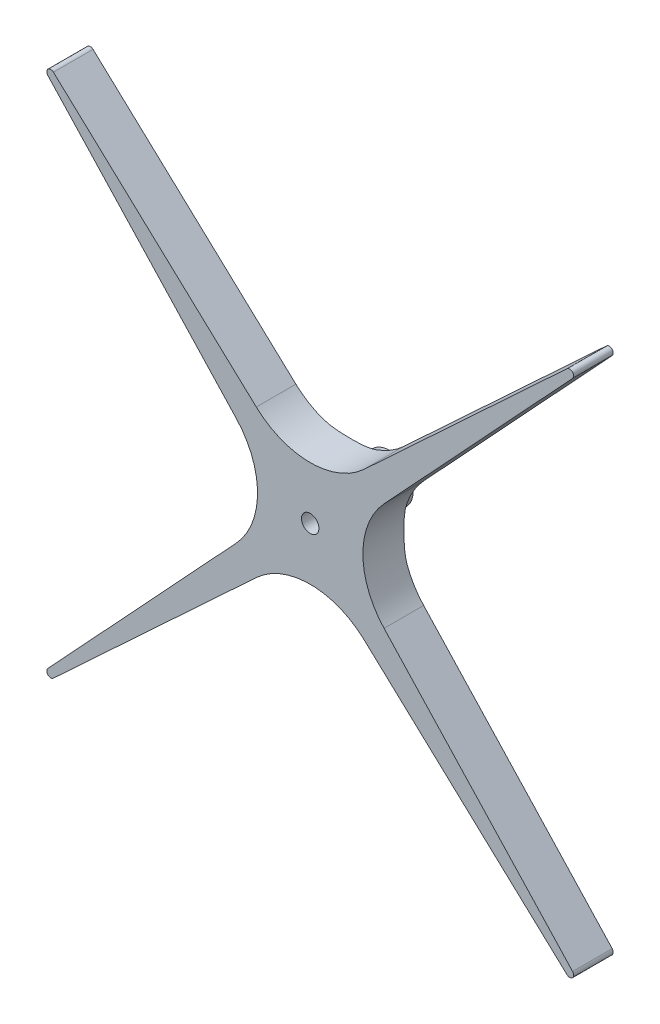
ISO-10303-21;
HEADER;
FILE_DESCRIPTION(('STEP AP214'),'2;1');
FILE_NAME('part.step','',(''),(''),'','','');
FILE_SCHEMA(('AUTOMOTIVE_DESIGN { 1 0 10303 214 1 1 1 1 }'));
ENDSEC;
DATA;
#1=APPLICATION_CONTEXT('core data for automotive mechanical design processes');
#2=APPLICATION_PROTOCOL_DEFINITION('international standard','automotive_design',2000,#1);
#3=PRODUCT_CONTEXT('',#1,'mechanical');
#4=PRODUCT('Part','Part','',(#3));
#5=PRODUCT_RELATED_PRODUCT_CATEGORY('part','',(#4));
#6=PRODUCT_DEFINITION_FORMATION('','',#4);
#7=PRODUCT_DEFINITION_CONTEXT('part definition',#1,'design');
#8=PRODUCT_DEFINITION('design','',#6,#7);
#9=PRODUCT_DEFINITION_SHAPE('','',#8);
#10=(LENGTH_UNIT() NAMED_UNIT(*) SI_UNIT(.MILLI.,.METRE.));
#11=(NAMED_UNIT(*) PLANE_ANGLE_UNIT() SI_UNIT($,.RADIAN.));
#12=(NAMED_UNIT(*) SI_UNIT($,.STERADIAN.) SOLID_ANGLE_UNIT());
#13=UNCERTAINTY_MEASURE_WITH_UNIT(LENGTH_MEASURE(1.E-05),#10,'distance_accuracy_value','');
#14=(GEOMETRIC_REPRESENTATION_CONTEXT(3) GLOBAL_UNCERTAINTY_ASSIGNED_CONTEXT((#13)) GLOBAL_UNIT_ASSIGNED_CONTEXT((#10,
#11,#12)) REPRESENTATION_CONTEXT('',''));
#15=CARTESIAN_POINT('',(0.,0.,0.));
#16=DIRECTION('',(0.,0.,1.));
#17=DIRECTION('',(1.,0.,0.));
#18=AXIS2_PLACEMENT_3D('',#15,#16,#17);
#19=CARTESIAN_POINT('',(0.,0.,0.));
#20=DIRECTION('',(0.,0.,1.));
#21=DIRECTION('',(1.,0.,0.));
#22=AXIS2_PLACEMENT_3D('',#19,#20,#21);
#23=PLANE('',#22);
#24=CARTESIAN_POINT('',(0.,0.,0.));
#25=DIRECTION('',(0.,0.,1.));
#26=DIRECTION('',(1.,0.,0.));
#27=AXIS2_PLACEMENT_3D('',#24,#25,#26);
#28=CIRCLE('',#27,3.);
#29=CARTESIAN_POINT('',(3.,0.,0.));
#30=VERTEX_POINT('',#29);
#31=CARTESIAN_POINT('',(0.,3.,0.));
#32=VERTEX_POINT('',#31);
#33=EDGE_CURVE('E408',#30,#32,#28,.T.);
#34=ORIENTED_EDGE('',*,*,#33,.F.);
#35=CARTESIAN_POINT('',(0.,-3.,0.));
#36=VERTEX_POINT('',#35);
#37=EDGE_CURVE('E407',#36,#30,#28,.T.);
#38=ORIENTED_EDGE('',*,*,#37,.F.);
#39=CARTESIAN_POINT('',(-3.,0.,0.));
#40=VERTEX_POINT('',#39);
#41=EDGE_CURVE('E533',#40,#36,#28,.T.);
#42=ORIENTED_EDGE('',*,*,#41,.F.);
#43=EDGE_CURVE('E412',#32,#40,#28,.T.);
#44=ORIENTED_EDGE('',*,*,#43,.F.);
#45=EDGE_LOOP('',(#34,#38,#42,#44));
#46=FACE_BOUND('',#45,.T.);
#47=CARTESIAN_POINT('',(0.,0.,0.));
#48=DIRECTION('',(0.,0.,1.));
#49=DIRECTION('',(1.,0.,0.));
#50=AXIS2_PLACEMENT_3D('',#47,#48,#49);
#51=CIRCLE('',#50,1.1);
#52=CARTESIAN_POINT('',(1.1,0.,0.));
#53=VERTEX_POINT('',#52);
#54=EDGE_CURVE('E403',#53,#53,#51,.T.);
#55=ORIENTED_EDGE('',*,*,#54,.T.);
#56=EDGE_LOOP('',(#55));
#57=FACE_BOUND('',#56,.T.);
#58=ADVANCED_FACE('F112',(#46,#57),#23,.F.);
#59=CARTESIAN_POINT('',(0.,0.,5.));
#60=DIRECTION('',(0.,0.,-1.));
#61=DIRECTION('',(-1.,0.,0.));
#62=AXIS2_PLACEMENT_3D('',#59,#60,#61);
#63=CYLINDRICAL_SURFACE('',#62,1.1);
#64=ORIENTED_EDGE('',*,*,#54,.F.);
#65=EDGE_LOOP('',(#64));
#66=FACE_BOUND('',#65,.T.);
#67=CARTESIAN_POINT('',(0.,0.,10.));
#68=DIRECTION('',(0.,0.,1.));
#69=DIRECTION('',(1.,0.,0.));
#70=AXIS2_PLACEMENT_3D('',#67,#68,#69);
#71=CIRCLE('',#70,1.1);
#72=CARTESIAN_POINT('',(1.1,0.,10.));
#73=VERTEX_POINT('',#72);
#74=EDGE_CURVE('E399',#73,#73,#71,.T.);
#75=ORIENTED_EDGE('',*,*,#74,.T.);
#76=EDGE_LOOP('',(#75));
#77=FACE_BOUND('',#76,.T.);
#78=ADVANCED_FACE('F542',(#66,#77),#63,.F.);
#79=CARTESIAN_POINT('',(0.,0.,10.));
#80=DIRECTION('',(0.,0.,1.));
#81=DIRECTION('',(1.,0.,0.));
#82=AXIS2_PLACEMENT_3D('',#79,#80,#81);
#83=PLANE('',#82);
#84=ORIENTED_EDGE('',*,*,#74,.F.);
#85=EDGE_LOOP('',(#84));
#86=FACE_BOUND('',#85,.T.);
#87=DIRECTION('',(-0.732531217967461,-0.680733438801936,0.));
#88=VECTOR('',#87,1.);
#89=CARTESIAN_POINT('',(1.49597548511027,-1.60980595589066,10.));
#90=LINE('',#89,#88);
#91=CARTESIAN_POINT('',(-6.80733438801901,-9.32598315726209,10.));
#92=VERTEX_POINT('',#91);
#93=CARTESIAN_POINT('',(-32.433116647063,-33.1397489754494,10.));
#94=VERTEX_POINT('',#93);
#95=EDGE_CURVE('E375',#92,#94,#90,.T.);
#96=ORIENTED_EDGE('',*,*,#95,.F.);
#97=CARTESIAN_POINT('',(3.45209971719385E-13,-16.6512953369367,10.));
#98=DIRECTION('',(0.,0.,1.));
#99=DIRECTION('',(1.,0.,0.));
#100=AXIS2_PLACEMENT_3D('',#97,#98,#99);
#101=CIRCLE('',#100,10.);
#102=CARTESIAN_POINT('',(6.80733438801931,-9.32598315726173,10.));
#103=VERTEX_POINT('',#102);
#104=EDGE_CURVE('E12',#92,#103,#101,.F.);
#105=ORIENTED_EDGE('',*,*,#104,.T.);
#106=DIRECTION('',(-0.732531217967497,0.680733438801897,0.));
#107=VECTOR('',#106,1.);
#108=CARTESIAN_POINT('',(-1.49597548511028,-1.60980595589084,10.));
#109=LINE('',#108,#107);
#110=CARTESIAN_POINT('',(32.4331166470648,-33.1397489754479,10.));
#111=VERTEX_POINT('',#110);
#112=EDGE_CURVE('E281',#111,#103,#109,.T.);
#113=ORIENTED_EDGE('',*,*,#112,.F.);
#114=CARTESIAN_POINT('',(32.7734833664657,-32.7734833664641,10.));
#115=DIRECTION('',(0.,0.,1.));
#116=DIRECTION('',(1.,0.,0.));
#117=AXIS2_PLACEMENT_3D('',#114,#115,#116);
#118=CIRCLE('',#117,0.499999999999992);
#119=CARTESIAN_POINT('',(33.1397489754494,-32.4331166470632,10.));
#120=VERTEX_POINT('',#119);
#121=EDGE_CURVE('E282',#120,#111,#118,.F.);
#122=ORIENTED_EDGE('',*,*,#121,.F.);
#123=DIRECTION('',(0.680733438801932,-0.732531217967464,0.));
#124=VECTOR('',#123,1.);
#125=CARTESIAN_POINT('',(1.60980595589077,1.49597548511035,10.));
#126=LINE('',#125,#124);
#127=CARTESIAN_POINT('',(9.32598315726216,-6.80733438801899,10.));
#128=VERTEX_POINT('',#127);
#129=EDGE_CURVE('E269',#128,#120,#126,.T.);
#130=ORIENTED_EDGE('',*,*,#129,.F.);
#131=CARTESIAN_POINT('',(16.6512953369368,3.29597460435593E-13,10.));
#132=DIRECTION('',(0.,0.,1.));
#133=DIRECTION('',(1.,0.,0.));
#134=AXIS2_PLACEMENT_3D('',#131,#132,#133);
#135=CIRCLE('',#134,10.);
#136=CARTESIAN_POINT('',(9.32598315726184,6.8073343880193,10.));
#137=VERTEX_POINT('',#136);
#138=EDGE_CURVE('E526',#128,#137,#135,.F.);
#139=ORIENTED_EDGE('',*,*,#138,.T.);
#140=DIRECTION('',(-0.680733438801897,-0.732531217967497,0.));
#141=VECTOR('',#140,1.);
#142=CARTESIAN_POINT('',(1.60980595589091,-1.49597548511034,10.));
#143=LINE('',#142,#141);
#144=CARTESIAN_POINT('',(33.1397489754479,32.4331166470646,10.));
#145=VERTEX_POINT('',#144);
#146=EDGE_CURVE('E321',#145,#137,#143,.T.);
#147=ORIENTED_EDGE('',*,*,#146,.F.);
#148=CARTESIAN_POINT('',(32.7734833664641,32.7734833664655,10.));
#149=DIRECTION('',(0.,0.,1.));
#150=DIRECTION('',(1.,0.,0.));
#151=AXIS2_PLACEMENT_3D('',#148,#149,#150);
#152=CIRCLE('',#151,0.499999999999995);
#153=CARTESIAN_POINT('',(32.4331166470632,33.1397489754493,10.));
#154=VERTEX_POINT('',#153);
#155=EDGE_CURVE('E313',#154,#145,#152,.F.);
#156=ORIENTED_EDGE('',*,*,#155,.F.);
#157=DIRECTION('',(0.732531217967464,0.680733438801932,0.));
#158=VECTOR('',#157,1.);
#159=CARTESIAN_POINT('',(-1.49597548511027,1.60980595589068,10.));
#160=LINE('',#159,#158);
#161=CARTESIAN_POINT('',(6.807334388019,9.32598315726203,10.));
#162=VERTEX_POINT('',#161);
#163=EDGE_CURVE('E317',#162,#154,#160,.T.);
#164=ORIENTED_EDGE('',*,*,#163,.F.);
#165=CARTESIAN_POINT('',(-3.19189119579733E-13,16.6512953369367,10.));
#166=DIRECTION('',(0.,0.,1.));
#167=DIRECTION('',(1.,0.,0.));
#168=AXIS2_PLACEMENT_3D('',#165,#166,#167);
#169=CIRCLE('',#168,10.);
#170=CARTESIAN_POINT('',(-6.80733438801929,9.3259831572617,10.));
#171=VERTEX_POINT('',#170);
#172=EDGE_CURVE('E797',#162,#171,#169,.F.);
#173=ORIENTED_EDGE('',*,*,#172,.T.);
#174=DIRECTION('',(0.732531217967497,-0.680733438801897,0.));
#175=VECTOR('',#174,1.);
#176=CARTESIAN_POINT('',(1.49597548511027,1.60980595589083,10.));
#177=LINE('',#176,#175);
#178=CARTESIAN_POINT('',(-32.4331166470646,33.1397489754478,10.));
#179=VERTEX_POINT('',#178);
#180=EDGE_CURVE('E350',#179,#171,#177,.T.);
#181=ORIENTED_EDGE('',*,*,#180,.F.);
#182=CARTESIAN_POINT('',(-32.7734833664656,32.773483366464,10.));
#183=DIRECTION('',(0.,0.,1.));
#184=DIRECTION('',(1.,0.,0.));
#185=AXIS2_PLACEMENT_3D('',#182,#183,#184);
#186=CIRCLE('',#185,0.499999999999999);
#187=CARTESIAN_POINT('',(-33.1397489754493,32.433116647063,10.));
#188=VERTEX_POINT('',#187);
#189=EDGE_CURVE('E342',#188,#179,#186,.F.);
#190=ORIENTED_EDGE('',*,*,#189,.F.);
#191=DIRECTION('',(-0.680733438801932,0.732531217967464,0.));
#192=VECTOR('',#191,1.);
#193=CARTESIAN_POINT('',(-1.60980595589076,-1.49597548511034,10.));
#194=LINE('',#193,#192);
#195=CARTESIAN_POINT('',(-9.32598315726202,6.80733438801884,10.));
#196=VERTEX_POINT('',#195);
#197=EDGE_CURVE('E346',#196,#188,#194,.T.);
#198=ORIENTED_EDGE('',*,*,#197,.F.);
#199=CARTESIAN_POINT('',(-16.6512953369367,-4.77048955893622E-13,10.));
#200=DIRECTION('',(0.,0.,1.));
#201=DIRECTION('',(1.,0.,0.));
#202=AXIS2_PLACEMENT_3D('',#199,#200,#201);
#203=CIRCLE('',#202,10.);
#204=CARTESIAN_POINT('',(-9.32598315726169,-6.80733438801944,10.));
#205=VERTEX_POINT('',#204);
#206=EDGE_CURVE('E778',#196,#205,#203,.F.);
#207=ORIENTED_EDGE('',*,*,#206,.T.);
#208=DIRECTION('',(0.680733438801897,0.732531217967497,0.));
#209=VECTOR('',#208,1.);
#210=CARTESIAN_POINT('',(-1.60980595589076,1.4959754851102,10.));
#211=LINE('',#210,#209);
#212=CARTESIAN_POINT('',(-33.1397489754477,-32.4331166470648,10.));
#213=VERTEX_POINT('',#212);
#214=EDGE_CURVE('E379',#213,#205,#211,.T.);
#215=ORIENTED_EDGE('',*,*,#214,.F.);
#216=CARTESIAN_POINT('',(-32.773483366464,-32.7734833664657,10.));
#217=DIRECTION('',(0.,0.,1.));
#218=DIRECTION('',(1.,0.,0.));
#219=AXIS2_PLACEMENT_3D('',#216,#217,#218);
#220=CIRCLE('',#219,0.499999999999995);
#221=EDGE_CURVE('E371',#94,#213,#220,.F.);
#222=ORIENTED_EDGE('',*,*,#221,.F.);
#223=EDGE_LOOP('',(#96,#105,#113,#122,#130,#139,#147,#156,#164,#173,#181,#190,#198,#207,#215,#222));
#224=FACE_BOUND('',#223,.T.);
#225=ADVANCED_FACE('F295',(#86,#224),#83,.T.);
#226=CARTESIAN_POINT('',(-32.773483366464,-32.7734833664657,10.));
#227=DIRECTION('',(0.,0.,-1.));
#228=DIRECTION('',(-1.,0.,0.));
#229=AXIS2_PLACEMENT_3D('',#226,#227,#228);
#230=CYLINDRICAL_SURFACE('',#229,0.499999999999995);
#231=CARTESIAN_POINT('',(-32.773483366464,-32.7734833664657,5.));
#232=DIRECTION('',(0.,0.,1.));
#233=DIRECTION('',(1.,0.,0.));
#234=AXIS2_PLACEMENT_3D('',#231,#232,#233);
#235=CIRCLE('',#234,0.499999999999995);
#236=CARTESIAN_POINT('',(-32.433116647063,-33.1397489754494,5.));
#237=VERTEX_POINT('',#236);
#238=CARTESIAN_POINT('',(-33.1397489754477,-32.4331166470648,5.));
#239=VERTEX_POINT('',#238);
#240=EDGE_CURVE('E370',#237,#239,#235,.F.);
#241=ORIENTED_EDGE('',*,*,#240,.F.);
#242=DIRECTION('',(0.,0.,-1.));
#243=VECTOR('',#242,1.);
#244=CARTESIAN_POINT('',(-32.433116647063,-33.1397489754494,10.));
#245=LINE('',#244,#243);
#246=EDGE_CURVE('E395',#94,#237,#245,.T.);
#247=ORIENTED_EDGE('',*,*,#246,.F.);
#248=ORIENTED_EDGE('',*,*,#221,.T.);
#249=DIRECTION('',(0.,0.,-1.));
#250=VECTOR('',#249,1.);
#251=CARTESIAN_POINT('',(-33.1397489754477,-32.4331166470648,10.));
#252=LINE('',#251,#250);
#253=EDGE_CURVE('E383',#213,#239,#252,.T.);
#254=ORIENTED_EDGE('',*,*,#253,.T.);
#255=EDGE_LOOP('',(#241,#247,#248,#254));
#256=FACE_BOUND('',#255,.T.);
#257=ADVANCED_FACE('F551',(#256),#230,.T.);
#258=CARTESIAN_POINT('',(1.49597548511027,-1.60980595589066,10.));
#259=DIRECTION('',(0.680733438801936,-0.732531217967461,0.));
#260=DIRECTION('',(0.732531217967461,0.680733438801936,0.));
#261=AXIS2_PLACEMENT_3D('',#258,#259,#260);
#262=PLANE('',#261);
#263=DIRECTION('',(-0.732531217967461,-0.680733438801936,0.));
#264=VECTOR('',#263,1.);
#265=CARTESIAN_POINT('',(1.49597548511027,-1.60980595589066,5.));
#266=LINE('',#265,#264);
#267=CARTESIAN_POINT('',(-6.80733438801901,-9.32598315726209,5.));
#268=VERTEX_POINT('',#267);
#269=EDGE_CURVE('E387',#268,#237,#266,.T.);
#270=ORIENTED_EDGE('',*,*,#269,.F.);
#271=DIRECTION('',(0.,0.,-1.));
#272=VECTOR('',#271,1.);
#273=CARTESIAN_POINT('',(-6.80733438801901,-9.32598315726209,10.));
#274=LINE('',#273,#272);
#275=EDGE_CURVE('E445',#268,#92,#274,.F.);
#276=ORIENTED_EDGE('',*,*,#275,.T.);
#277=ORIENTED_EDGE('',*,*,#95,.T.);
#278=ORIENTED_EDGE('',*,*,#246,.T.);
#279=EDGE_LOOP('',(#270,#276,#277,#278));
#280=FACE_BOUND('',#279,.T.);
#281=ADVANCED_FACE('F512',(#280),#262,.T.);
#282=CARTESIAN_POINT('',(-1.60980595589076,1.4959754851102,10.));
#283=DIRECTION('',(-0.732531217967497,0.680733438801897,0.));
#284=DIRECTION('',(-0.680733438801897,-0.732531217967497,0.));
#285=AXIS2_PLACEMENT_3D('',#282,#283,#284);
#286=PLANE('',#285);
#287=ORIENTED_EDGE('',*,*,#214,.T.);
#288=DIRECTION('',(0.,0.,-1.));
#289=VECTOR('',#288,1.);
#290=CARTESIAN_POINT('',(-9.32598315726169,-6.80733438801945,0.));
#291=LINE('',#290,#289);
#292=CARTESIAN_POINT('',(-9.32598315726169,-6.80733438801944,5.));
#293=VERTEX_POINT('',#292);
#294=EDGE_CURVE('E434',#205,#293,#291,.T.);
#295=ORIENTED_EDGE('',*,*,#294,.T.);
#296=DIRECTION('',(0.680733438801897,0.732531217967497,0.));
#297=VECTOR('',#296,1.);
#298=CARTESIAN_POINT('',(-1.60980595589076,1.4959754851102,5.));
#299=LINE('',#298,#297);
#300=EDGE_CURVE('E376',#239,#293,#299,.T.);
#301=ORIENTED_EDGE('',*,*,#300,.F.);
#302=ORIENTED_EDGE('',*,*,#253,.F.);
#303=EDGE_LOOP('',(#287,#295,#301,#302));
#304=FACE_BOUND('',#303,.T.);
#305=ADVANCED_FACE('F561',(#304),#286,.T.);
#306=CARTESIAN_POINT('',(0.,0.,5.));
#307=DIRECTION('',(0.,0.,1.));
#308=DIRECTION('',(1.,0.,0.));
#309=AXIS2_PLACEMENT_3D('',#306,#307,#308);
#310=PLANE('',#309);
#311=ORIENTED_EDGE('',*,*,#300,.T.);
#312=CARTESIAN_POINT('',(-16.6512953369367,-4.77048955893622E-13,5.));
#313=DIRECTION('',(0.,0.,1.));
#314=DIRECTION('',(1.,0.,0.));
#315=AXIS2_PLACEMENT_3D('',#312,#313,#314);
#316=CIRCLE('',#315,10.);
#317=CARTESIAN_POINT('',(-7.24465068680529,-3.39338126743395,5.));
#318=VERTEX_POINT('',#317);
#319=EDGE_CURVE('E795',#293,#318,#316,.T.);
#320=ORIENTED_EDGE('',*,*,#319,.T.);
#321=CARTESIAN_POINT('',(0.,0.,5.));
#322=DIRECTION('',(0.,0.,1.));
#323=DIRECTION('',(1.,0.,0.));
#324=AXIS2_PLACEMENT_3D('',#321,#322,#323);
#325=CIRCLE('',#324,8.);
#326=CARTESIAN_POINT('',(-3.39338126743355,-7.24465068680547,5.));
#327=VERTEX_POINT('',#326);
#328=EDGE_CURVE('E129',#318,#327,#325,.T.);
#329=ORIENTED_EDGE('',*,*,#328,.T.);
#330=CARTESIAN_POINT('',(3.45209971719385E-13,-16.6512953369367,5.));
#331=DIRECTION('',(0.,0.,1.));
#332=DIRECTION('',(1.,0.,0.));
#333=AXIS2_PLACEMENT_3D('',#330,#331,#332);
#334=CIRCLE('',#333,10.);
#335=EDGE_CURVE('E122',#327,#268,#334,.T.);
#336=ORIENTED_EDGE('',*,*,#335,.T.);
#337=ORIENTED_EDGE('',*,*,#269,.T.);
#338=ORIENTED_EDGE('',*,*,#240,.T.);
#339=EDGE_LOOP('',(#311,#320,#329,#336,#337,#338));
#340=FACE_BOUND('',#339,.T.);
#341=ADVANCED_FACE('F507',(#340),#310,.F.);
#342=CARTESIAN_POINT('',(-32.7734833664656,32.773483366464,10.));
#343=DIRECTION('',(0.,0.,-1.));
#344=DIRECTION('',(-1.,0.,0.));
#345=AXIS2_PLACEMENT_3D('',#342,#343,#344);
#346=CYLINDRICAL_SURFACE('',#345,0.499999999999999);
#347=CARTESIAN_POINT('',(-32.7734833664656,32.773483366464,5.));
#348=DIRECTION('',(0.,0.,1.));
#349=DIRECTION('',(1.,0.,0.));
#350=AXIS2_PLACEMENT_3D('',#347,#348,#349);
#351=CIRCLE('',#350,0.499999999999999);
#352=CARTESIAN_POINT('',(-33.1397489754493,32.433116647063,5.));
#353=VERTEX_POINT('',#352);
#354=CARTESIAN_POINT('',(-32.4331166470646,33.1397489754478,5.));
#355=VERTEX_POINT('',#354);
#356=EDGE_CURVE('E341',#353,#355,#351,.F.);
#357=ORIENTED_EDGE('',*,*,#356,.F.);
#358=DIRECTION('',(0.,0.,-1.));
#359=VECTOR('',#358,1.);
#360=CARTESIAN_POINT('',(-33.1397489754493,32.433116647063,10.));
#361=LINE('',#360,#359);
#362=EDGE_CURVE('E366',#188,#353,#361,.T.);
#363=ORIENTED_EDGE('',*,*,#362,.F.);
#364=ORIENTED_EDGE('',*,*,#189,.T.);
#365=DIRECTION('',(0.,0.,-1.));
#366=VECTOR('',#365,1.);
#367=CARTESIAN_POINT('',(-32.4331166470646,33.1397489754478,10.));
#368=LINE('',#367,#366);
#369=EDGE_CURVE('E354',#179,#355,#368,.T.);
#370=ORIENTED_EDGE('',*,*,#369,.T.);
#371=EDGE_LOOP('',(#357,#363,#364,#370));
#372=FACE_BOUND('',#371,.T.);
#373=ADVANCED_FACE('F567',(#372),#346,.T.);
#374=CARTESIAN_POINT('',(-1.60980595589076,-1.49597548511034,10.));
#375=DIRECTION('',(-0.732531217967464,-0.680733438801932,0.));
#376=DIRECTION('',(0.680733438801932,-0.732531217967464,0.));
#377=AXIS2_PLACEMENT_3D('',#374,#375,#376);
#378=PLANE('',#377);
#379=DIRECTION('',(-0.680733438801932,0.732531217967464,0.));
#380=VECTOR('',#379,1.);
#381=CARTESIAN_POINT('',(-1.60980595589076,-1.49597548511034,5.));
#382=LINE('',#381,#380);
#383=CARTESIAN_POINT('',(-9.32598315726202,6.80733438801884,5.));
#384=VERTEX_POINT('',#383);
#385=EDGE_CURVE('E358',#384,#353,#382,.T.);
#386=ORIENTED_EDGE('',*,*,#385,.F.);
#387=DIRECTION('',(0.,0.,-1.));
#388=VECTOR('',#387,1.);
#389=CARTESIAN_POINT('',(-9.32598315726202,6.80733438801884,10.));
#390=LINE('',#389,#388);
#391=EDGE_CURVE('E438',#384,#196,#390,.F.);
#392=ORIENTED_EDGE('',*,*,#391,.T.);
#393=ORIENTED_EDGE('',*,*,#197,.T.);
#394=ORIENTED_EDGE('',*,*,#362,.T.);
#395=EDGE_LOOP('',(#386,#392,#393,#394));
#396=FACE_BOUND('',#395,.T.);
#397=ADVANCED_FACE('F570',(#396),#378,.T.);
#398=CARTESIAN_POINT('',(1.49597548511027,1.60980595589083,10.));
#399=DIRECTION('',(0.680733438801897,0.732531217967497,0.));
#400=DIRECTION('',(-0.732531217967497,0.680733438801897,0.));
#401=AXIS2_PLACEMENT_3D('',#398,#399,#400);
#402=PLANE('',#401);
#403=ORIENTED_EDGE('',*,*,#180,.T.);
#404=DIRECTION('',(0.,0.,-1.));
#405=VECTOR('',#404,1.);
#406=CARTESIAN_POINT('',(-6.80733438801929,9.3259831572617,0.));
#407=LINE('',#406,#405);
#408=CARTESIAN_POINT('',(-6.80733438801929,9.3259831572617,5.));
#409=VERTEX_POINT('',#408);
#410=EDGE_CURVE('E427',#171,#409,#407,.T.);
#411=ORIENTED_EDGE('',*,*,#410,.T.);
#412=DIRECTION('',(0.732531217967497,-0.680733438801897,0.));
#413=VECTOR('',#412,1.);
#414=CARTESIAN_POINT('',(1.49597548511027,1.60980595589083,5.));
#415=LINE('',#414,#413);
#416=EDGE_CURVE('E347',#355,#409,#415,.T.);
#417=ORIENTED_EDGE('',*,*,#416,.F.);
#418=ORIENTED_EDGE('',*,*,#369,.F.);
#419=EDGE_LOOP('',(#403,#411,#417,#418));
#420=FACE_BOUND('',#419,.T.);
#421=ADVANCED_FACE('F574',(#420),#402,.T.);
#422=CARTESIAN_POINT('',(0.,0.,5.));
#423=DIRECTION('',(0.,0.,1.));
#424=DIRECTION('',(1.,0.,0.));
#425=AXIS2_PLACEMENT_3D('',#422,#423,#424);
#426=PLANE('',#425);
#427=ORIENTED_EDGE('',*,*,#416,.T.);
#428=CARTESIAN_POINT('',(-3.19189119579733E-13,16.6512953369367,5.));
#429=DIRECTION('',(0.,0.,1.));
#430=DIRECTION('',(1.,0.,0.));
#431=AXIS2_PLACEMENT_3D('',#428,#429,#430);
#432=CIRCLE('',#431,10.);
#433=CARTESIAN_POINT('',(-3.39338126743388,7.24465068680532,5.));
#434=VERTEX_POINT('',#433);
#435=EDGE_CURVE('E486',#409,#434,#432,.T.);
#436=ORIENTED_EDGE('',*,*,#435,.T.);
#437=CARTESIAN_POINT('',(0.,0.,5.));
#438=DIRECTION('',(0.,0.,1.));
#439=DIRECTION('',(1.,0.,0.));
#440=AXIS2_PLACEMENT_3D('',#437,#438,#439);
#441=CIRCLE('',#440,8.);
#442=CARTESIAN_POINT('',(-7.24465068680548,3.39338126743354,5.));
#443=VERTEX_POINT('',#442);
#444=EDGE_CURVE('E158',#434,#443,#441,.T.);
#445=ORIENTED_EDGE('',*,*,#444,.T.);
#446=CARTESIAN_POINT('',(-16.6512953369367,-4.77048955893622E-13,5.));
#447=DIRECTION('',(0.,0.,1.));
#448=DIRECTION('',(1.,0.,0.));
#449=AXIS2_PLACEMENT_3D('',#446,#447,#448);
#450=CIRCLE('',#449,10.);
#451=EDGE_CURVE('E783',#443,#384,#450,.T.);
#452=ORIENTED_EDGE('',*,*,#451,.T.);
#453=ORIENTED_EDGE('',*,*,#385,.T.);
#454=ORIENTED_EDGE('',*,*,#356,.T.);
#455=EDGE_LOOP('',(#427,#436,#445,#452,#453,#454));
#456=FACE_BOUND('',#455,.T.);
#457=ADVANCED_FACE('F578',(#456),#426,.F.);
#458=CARTESIAN_POINT('',(32.7734833664641,32.7734833664655,10.));
#459=DIRECTION('',(0.,0.,-1.));
#460=DIRECTION('',(-1.,0.,0.));
#461=AXIS2_PLACEMENT_3D('',#458,#459,#460);
#462=CYLINDRICAL_SURFACE('',#461,0.499999999999995);
#463=CARTESIAN_POINT('',(32.7734833664641,32.7734833664655,5.));
#464=DIRECTION('',(0.,0.,1.));
#465=DIRECTION('',(1.,0.,0.));
#466=AXIS2_PLACEMENT_3D('',#463,#464,#465);
#467=CIRCLE('',#466,0.499999999999995);
#468=CARTESIAN_POINT('',(32.4331166470632,33.1397489754493,5.));
#469=VERTEX_POINT('',#468);
#470=CARTESIAN_POINT('',(33.1397489754479,32.4331166470646,5.));
#471=VERTEX_POINT('',#470);
#472=EDGE_CURVE('E291',#469,#471,#467,.F.);
#473=ORIENTED_EDGE('',*,*,#472,.F.);
#474=DIRECTION('',(0.,0.,-1.));
#475=VECTOR('',#474,1.);
#476=CARTESIAN_POINT('',(32.4331166470632,33.1397489754493,10.));
#477=LINE('',#476,#475);
#478=EDGE_CURVE('E337',#154,#469,#477,.T.);
#479=ORIENTED_EDGE('',*,*,#478,.F.);
#480=ORIENTED_EDGE('',*,*,#155,.T.);
#481=DIRECTION('',(0.,0.,-1.));
#482=VECTOR('',#481,1.);
#483=CARTESIAN_POINT('',(33.1397489754479,32.4331166470646,10.));
#484=LINE('',#483,#482);
#485=EDGE_CURVE('E325',#145,#471,#484,.T.);
#486=ORIENTED_EDGE('',*,*,#485,.T.);
#487=EDGE_LOOP('',(#473,#479,#480,#486));
#488=FACE_BOUND('',#487,.T.);
#489=ADVANCED_FACE('F582',(#488),#462,.T.);
#490=CARTESIAN_POINT('',(-1.49597548511027,1.60980595589068,10.));
#491=DIRECTION('',(-0.680733438801932,0.732531217967464,0.));
#492=DIRECTION('',(-0.732531217967464,-0.680733438801932,0.));
#493=AXIS2_PLACEMENT_3D('',#490,#491,#492);
#494=PLANE('',#493);
#495=DIRECTION('',(0.732531217967464,0.680733438801932,0.));
#496=VECTOR('',#495,1.);
#497=CARTESIAN_POINT('',(-1.49597548511027,1.60980595589068,5.));
#498=LINE('',#497,#496);
#499=CARTESIAN_POINT('',(6.807334388019,9.32598315726203,5.));
#500=VERTEX_POINT('',#499);
#501=EDGE_CURVE('E329',#500,#469,#498,.T.);
#502=ORIENTED_EDGE('',*,*,#501,.F.);
#503=DIRECTION('',(0.,0.,-1.));
#504=VECTOR('',#503,1.);
#505=CARTESIAN_POINT('',(6.807334388019,9.32598315726202,10.));
#506=LINE('',#505,#504);
#507=EDGE_CURVE('E431',#500,#162,#506,.F.);
#508=ORIENTED_EDGE('',*,*,#507,.T.);
#509=ORIENTED_EDGE('',*,*,#163,.T.);
#510=ORIENTED_EDGE('',*,*,#478,.T.);
#511=EDGE_LOOP('',(#502,#508,#509,#510));
#512=FACE_BOUND('',#511,.T.);
#513=ADVANCED_FACE('F586',(#512),#494,.T.);
#514=CARTESIAN_POINT('',(1.60980595589091,-1.49597548511034,10.));
#515=DIRECTION('',(0.732531217967497,-0.680733438801897,0.));
#516=DIRECTION('',(0.680733438801897,0.732531217967497,0.));
#517=AXIS2_PLACEMENT_3D('',#514,#515,#516);
#518=PLANE('',#517);
#519=ORIENTED_EDGE('',*,*,#146,.T.);
#520=DIRECTION('',(0.,0.,-1.));
#521=VECTOR('',#520,1.);
#522=CARTESIAN_POINT('',(9.32598315726184,6.8073343880193,0.));
#523=LINE('',#522,#521);
#524=CARTESIAN_POINT('',(9.32598315726184,6.8073343880193,5.));
#525=VERTEX_POINT('',#524);
#526=EDGE_CURVE('E421',#137,#525,#523,.T.);
#527=ORIENTED_EDGE('',*,*,#526,.T.);
#528=DIRECTION('',(-0.680733438801897,-0.732531217967497,0.));
#529=VECTOR('',#528,1.);
#530=CARTESIAN_POINT('',(1.60980595589091,-1.49597548511034,5.));
#531=LINE('',#530,#529);
#532=EDGE_CURVE('E318',#471,#525,#531,.T.);
#533=ORIENTED_EDGE('',*,*,#532,.F.);
#534=ORIENTED_EDGE('',*,*,#485,.F.);
#535=EDGE_LOOP('',(#519,#527,#533,#534));
#536=FACE_BOUND('',#535,.T.);
#537=ADVANCED_FACE('F590',(#536),#518,.T.);
#538=CARTESIAN_POINT('',(0.,0.,5.));
#539=DIRECTION('',(0.,0.,1.));
#540=DIRECTION('',(1.,0.,0.));
#541=AXIS2_PLACEMENT_3D('',#538,#539,#540);
#542=PLANE('',#541);
#543=ORIENTED_EDGE('',*,*,#532,.T.);
#544=CARTESIAN_POINT('',(16.6512953369368,3.29597460435593E-13,5.));
#545=DIRECTION('',(0.,0.,1.));
#546=DIRECTION('',(1.,0.,0.));
#547=AXIS2_PLACEMENT_3D('',#544,#545,#546);
#548=CIRCLE('',#547,10.);
#549=CARTESIAN_POINT('',(7.2446506868054,3.39338126743371,5.));
#550=VERTEX_POINT('',#549);
#551=EDGE_CURVE('E448',#525,#550,#548,.T.);
#552=ORIENTED_EDGE('',*,*,#551,.T.);
#553=CARTESIAN_POINT('',(0.,0.,5.));
#554=DIRECTION('',(0.,0.,1.));
#555=DIRECTION('',(1.,0.,0.));
#556=AXIS2_PLACEMENT_3D('',#553,#554,#555);
#557=CIRCLE('',#556,8.);
#558=CARTESIAN_POINT('',(3.3933812674336,7.24465068680545,5.));
#559=VERTEX_POINT('',#558);
#560=EDGE_CURVE('E154',#550,#559,#557,.T.);
#561=ORIENTED_EDGE('',*,*,#560,.T.);
#562=CARTESIAN_POINT('',(-3.19189119579733E-13,16.6512953369367,5.));
#563=DIRECTION('',(0.,0.,1.));
#564=DIRECTION('',(1.,0.,0.));
#565=AXIS2_PLACEMENT_3D('',#562,#563,#564);
#566=CIRCLE('',#565,10.);
#567=EDGE_CURVE('E485',#559,#500,#566,.T.);
#568=ORIENTED_EDGE('',*,*,#567,.T.);
#569=ORIENTED_EDGE('',*,*,#501,.T.);
#570=ORIENTED_EDGE('',*,*,#472,.T.);
#571=EDGE_LOOP('',(#543,#552,#561,#568,#569,#570));
#572=FACE_BOUND('',#571,.T.);
#573=ADVANCED_FACE('F594',(#572),#542,.F.);
#574=CARTESIAN_POINT('',(32.7734833664657,-32.7734833664641,10.));
#575=DIRECTION('',(0.,0.,-1.));
#576=DIRECTION('',(-1.,0.,0.));
#577=AXIS2_PLACEMENT_3D('',#574,#575,#576);
#578=CYLINDRICAL_SURFACE('',#577,0.499999999999992);
#579=CARTESIAN_POINT('',(32.7734833664657,-32.7734833664641,5.));
#580=DIRECTION('',(0.,0.,1.));
#581=DIRECTION('',(1.,0.,0.));
#582=AXIS2_PLACEMENT_3D('',#579,#580,#581);
#583=CIRCLE('',#582,0.499999999999992);
#584=CARTESIAN_POINT('',(33.1397489754494,-32.4331166470632,5.));
#585=VERTEX_POINT('',#584);
#586=CARTESIAN_POINT('',(32.4331166470648,-33.1397489754479,5.));
#587=VERTEX_POINT('',#586);
#588=EDGE_CURVE('E289',#585,#587,#583,.F.);
#589=ORIENTED_EDGE('',*,*,#588,.F.);
#590=DIRECTION('',(0.,0.,-1.));
#591=VECTOR('',#590,1.);
#592=CARTESIAN_POINT('',(33.1397489754494,-32.4331166470632,10.));
#593=LINE('',#592,#591);
#594=EDGE_CURVE('E273',#120,#585,#593,.T.);
#595=ORIENTED_EDGE('',*,*,#594,.F.);
#596=ORIENTED_EDGE('',*,*,#121,.T.);
#597=DIRECTION('',(0.,0.,-1.));
#598=VECTOR('',#597,1.);
#599=CARTESIAN_POINT('',(32.4331166470648,-33.1397489754479,10.));
#600=LINE('',#599,#598);
#601=EDGE_CURVE('E292',#111,#587,#600,.T.);
#602=ORIENTED_EDGE('',*,*,#601,.T.);
#603=EDGE_LOOP('',(#589,#595,#596,#602));
#604=FACE_BOUND('',#603,.T.);
#605=ADVANCED_FACE('F286',(#604),#578,.T.);
#606=CARTESIAN_POINT('',(1.60980595589077,1.49597548511035,10.));
#607=DIRECTION('',(0.732531217967464,0.680733438801932,0.));
#608=DIRECTION('',(-0.680733438801932,0.732531217967464,0.));
#609=AXIS2_PLACEMENT_3D('',#606,#607,#608);
#610=PLANE('',#609);
#611=DIRECTION('',(0.680733438801932,-0.732531217967464,0.));
#612=VECTOR('',#611,1.);
#613=CARTESIAN_POINT('',(1.60980595589077,1.49597548511035,5.));
#614=LINE('',#613,#612);
#615=CARTESIAN_POINT('',(9.32598315726216,-6.80733438801899,5.));
#616=VERTEX_POINT('',#615);
#617=EDGE_CURVE('E302',#616,#585,#614,.T.);
#618=ORIENTED_EDGE('',*,*,#617,.F.);
#619=DIRECTION('',(0.,0.,-1.));
#620=VECTOR('',#619,1.);
#621=CARTESIAN_POINT('',(9.32598315726216,-6.80733438801899,10.));
#622=LINE('',#621,#620);
#623=EDGE_CURVE('E276',#616,#128,#622,.F.);
#624=ORIENTED_EDGE('',*,*,#623,.T.);
#625=ORIENTED_EDGE('',*,*,#129,.T.);
#626=ORIENTED_EDGE('',*,*,#594,.T.);
#627=EDGE_LOOP('',(#618,#624,#625,#626));
#628=FACE_BOUND('',#627,.T.);
#629=ADVANCED_FACE('F272',(#628),#610,.T.);
#630=CARTESIAN_POINT('',(-1.49597548511028,-1.60980595589084,10.));
#631=DIRECTION('',(-0.680733438801897,-0.732531217967497,0.));
#632=DIRECTION('',(0.732531217967497,-0.680733438801897,0.));
#633=AXIS2_PLACEMENT_3D('',#630,#631,#632);
#634=PLANE('',#633);
#635=ORIENTED_EDGE('',*,*,#112,.T.);
#636=DIRECTION('',(0.,0.,-1.));
#637=VECTOR('',#636,1.);
#638=CARTESIAN_POINT('',(6.80733438801931,-9.32598315726172,0.));
#639=LINE('',#638,#637);
#640=CARTESIAN_POINT('',(6.80733438801931,-9.32598315726173,5.));
#641=VERTEX_POINT('',#640);
#642=EDGE_CURVE('E441',#103,#641,#639,.T.);
#643=ORIENTED_EDGE('',*,*,#642,.T.);
#644=DIRECTION('',(-0.732531217967497,0.680733438801897,0.));
#645=VECTOR('',#644,1.);
#646=CARTESIAN_POINT('',(-1.49597548511028,-1.60980595589084,5.));
#647=LINE('',#646,#645);
#648=EDGE_CURVE('E298',#587,#641,#647,.T.);
#649=ORIENTED_EDGE('',*,*,#648,.F.);
#650=ORIENTED_EDGE('',*,*,#601,.F.);
#651=EDGE_LOOP('',(#635,#643,#649,#650));
#652=FACE_BOUND('',#651,.T.);
#653=ADVANCED_FACE('F519',(#652),#634,.T.);
#654=CARTESIAN_POINT('',(0.,0.,5.));
#655=DIRECTION('',(0.,0.,1.));
#656=DIRECTION('',(1.,0.,0.));
#657=AXIS2_PLACEMENT_3D('',#654,#655,#656);
#658=PLANE('',#657);
#659=ORIENTED_EDGE('',*,*,#648,.T.);
#660=CARTESIAN_POINT('',(3.45209971719385E-13,-16.6512953369367,5.));
#661=DIRECTION('',(0.,0.,1.));
#662=DIRECTION('',(1.,0.,0.));
#663=AXIS2_PLACEMENT_3D('',#660,#661,#662);
#664=CIRCLE('',#663,10.);
#665=CARTESIAN_POINT('',(3.39338126743385,-7.24465068680534,5.));
#666=VERTEX_POINT('',#665);
#667=EDGE_CURVE('E502',#641,#666,#664,.T.);
#668=ORIENTED_EDGE('',*,*,#667,.T.);
#669=CARTESIAN_POINT('',(0.,0.,5.));
#670=DIRECTION('',(0.,0.,1.));
#671=DIRECTION('',(1.,0.,0.));
#672=AXIS2_PLACEMENT_3D('',#669,#670,#671);
#673=CIRCLE('',#672,8.);
#674=CARTESIAN_POINT('',(7.24465068680554,-3.39338126743342,5.));
#675=VERTEX_POINT('',#674);
#676=EDGE_CURVE('E137',#666,#675,#673,.T.);
#677=ORIENTED_EDGE('',*,*,#676,.T.);
#678=CARTESIAN_POINT('',(16.6512953369368,3.29597460435593E-13,5.));
#679=DIRECTION('',(0.,0.,1.));
#680=DIRECTION('',(1.,0.,0.));
#681=AXIS2_PLACEMENT_3D('',#678,#679,#680);
#682=CIRCLE('',#681,10.);
#683=EDGE_CURVE('E460',#675,#616,#682,.T.);
#684=ORIENTED_EDGE('',*,*,#683,.T.);
#685=ORIENTED_EDGE('',*,*,#617,.T.);
#686=ORIENTED_EDGE('',*,*,#588,.T.);
#687=EDGE_LOOP('',(#659,#668,#677,#684,#685,#686));
#688=FACE_BOUND('',#687,.T.);
#689=ADVANCED_FACE('F522',(#688),#658,.F.);
#690=CARTESIAN_POINT('',(0.,0.,0.));
#691=DIRECTION('',(0.,0.,1.));
#692=DIRECTION('',(1.,0.,0.));
#693=AXIS2_PLACEMENT_3D('',#690,#691,#692);
#694=TOROIDAL_SURFACE('',#693,8.,5.);
#695=ORIENTED_EDGE('',*,*,#41,.T.);
#696=ORIENTED_EDGE('',*,*,#37,.T.);
#697=ORIENTED_EDGE('',*,*,#33,.T.);
#698=ORIENTED_EDGE('',*,*,#43,.T.);
#699=EDGE_LOOP('',(#695,#696,#697,#698));
#700=FACE_BOUND('',#699,.T.);
#701=ORIENTED_EDGE('',*,*,#328,.F.);
#702=CARTESIAN_POINT('',(-7.2446506868057,-3.39338126743414,5.));
#703=CARTESIAN_POINT('',(-7.2006240097495,-3.27134180605591,5.00001008630353));
#704=CARTESIAN_POINT('',(-7.15899522744542,-3.14849932102904,4.99748143199834));
#705=CARTESIAN_POINT('',(-7.08060097063563,-2.90147932610814,4.98854495193032));
#706=CARTESIAN_POINT('',(-7.04383285104846,-2.77730258240723,4.98213924666164));
#707=CARTESIAN_POINT('',(-6.94081553558363,-2.40284158708999,4.95888861178659));
#708=CARTESIAN_POINT('',(-6.88190074834673,-2.15075802801724,4.93801271864364));
#709=CARTESIAN_POINT('',(-6.80850714045857,-1.77087674941335,4.90616143598954));
#710=CARTESIAN_POINT('',(-6.78659112529929,-1.64441342101406,4.89549395610192));
#711=CARTESIAN_POINT('',(-6.74763351374952,-1.39066554258869,4.87510693721505));
#712=CARTESIAN_POINT('',(-6.73059119783772,-1.2633811166243,4.86538725842837));
#713=CARTESIAN_POINT('',(-6.70142172247864,-1.00821298193931,4.84793587809189));
#714=CARTESIAN_POINT('',(-6.68929077913579,-0.880329811651507,4.84020264779735));
#715=CARTESIAN_POINT('',(-6.66995893547474,-0.624047595321487,4.8275406687994));
#716=CARTESIAN_POINT('',(-6.66275802811004,-0.495648550016876,4.82261191608754));
#717=CARTESIAN_POINT('',(-6.65307936674698,-0.232179871659743,4.81593421192361));
#718=CARTESIAN_POINT('',(-6.65085458144245,-0.0970963624527201,4.81435576866188));
#719=CARTESIAN_POINT('',(-6.65188027847917,0.173039901701483,4.8150746461381));
#720=CARTESIAN_POINT('',(-6.65513081436688,0.308092656334977,4.81737200477984));
#721=CARTESIAN_POINT('',(-6.66709689221992,0.577963612502995,4.82556839757013));
#722=CARTESIAN_POINT('',(-6.67581733164101,0.712781495156831,4.83147065922926));
#723=CARTESIAN_POINT('',(-6.69869202401389,0.981790714749416,4.84617511296764));
#724=CARTESIAN_POINT('',(-6.7128463547681,1.11598204268931,4.85497734656841));
#725=CARTESIAN_POINT('',(-6.74650249924971,1.3831686605504,4.87441901570218));
#726=CARTESIAN_POINT('',(-6.76598901526145,1.51616626462224,4.88505316373345));
#727=CARTESIAN_POINT('',(-6.8102936203681,1.78122227545936,4.90693687982643));
#728=CARTESIAN_POINT('',(-6.83511260665612,1.91328052030904,4.91818655121281));
#729=CARTESIAN_POINT('',(-6.91749471729724,2.30762921154229,4.95079702398055));
#730=CARTESIAN_POINT('',(-6.98302822647605,2.56845255529315,4.97105250348881));
#731=CARTESIAN_POINT('',(-7.08715458358269,2.92183176753496,4.98917601718452));
#732=CARTESIAN_POINT('',(-7.11668679672384,3.01680904101744,4.99310744329632));
#733=CARTESIAN_POINT('',(-7.17856293811218,3.20581021745277,4.99851958885337));
#734=CARTESIAN_POINT('',(-7.2109041353888,3.29983494932151,5.00000266119272));
#735=CARTESIAN_POINT('',(-7.24465068680624,3.39338126743363,5.));
#736=B_SPLINE_CURVE_WITH_KNOTS('',3,(#702,#703,#704,#705,#706,#707,#708,#709,#710,#711,#712,
#713,#714,#715,#716,#717,#718,#719,#720,#721,#722,#723,#724,#725,#726,#727,#728,#729,#730,#731,
#732,#733,#734,#735),.UNSPECIFIED.,.F.,.F.,(4,2,2,2,2,2,2,2,2,2,2,2,2,2,2,2,4),(0.,
0.389072193351607,0.77793178162816,1.55606866111692,1.94237734294014,2.32862896317952,
2.71458243258396,3.10053535034391,3.50570142451358,3.91087146106785,4.3164047837928,
4.72194391315829,5.12633155789007,5.53078729457583,6.33861154876471,6.63717268004251,
6.93544672350828),.UNSPECIFIED.);
#737=EDGE_CURVE('E786',#318,#443,#736,.T.);
#738=ORIENTED_EDGE('',*,*,#737,.T.);
#739=ORIENTED_EDGE('',*,*,#444,.F.);
#740=CARTESIAN_POINT('',(-3.39338126743407,7.24465068680573,5.));
#741=CARTESIAN_POINT('',(-3.27134180605584,7.20062400974953,5.00001008630353));
#742=CARTESIAN_POINT('',(-3.14849932102896,7.15899522744545,4.99748143199834));
#743=CARTESIAN_POINT('',(-2.90147932610807,7.08060097063565,4.98854495193032));
#744=CARTESIAN_POINT('',(-2.77730258240716,7.04383285104848,4.98213924666164));
#745=CARTESIAN_POINT('',(-2.40284158708991,6.94081553558365,4.95888861178659));
#746=CARTESIAN_POINT('',(-2.15075802801717,6.88190074834675,4.93801271864363));
#747=CARTESIAN_POINT('',(-1.77087674941328,6.80850714045859,4.90616143598954));
#748=CARTESIAN_POINT('',(-1.64441342101399,6.7865911252993,4.89549395610192));
#749=CARTESIAN_POINT('',(-1.39066554258862,6.74763351374954,4.87510693721505));
#750=CARTESIAN_POINT('',(-1.26338111662423,6.73059119783773,4.86538725842837));
#751=CARTESIAN_POINT('',(-1.00821298193924,6.70142172247865,4.84793587809189));
#752=CARTESIAN_POINT('',(-0.880329811651436,6.6892907791358,4.84020264779735));
#753=CARTESIAN_POINT('',(-0.624047595321416,6.66995893547475,4.8275406687994));
#754=CARTESIAN_POINT('',(-0.495648550016805,6.66275802811005,4.82261191608754));
#755=CARTESIAN_POINT('',(-0.232179871659672,6.65307936674698,4.81593421192361));
#756=CARTESIAN_POINT('',(-0.0970963624526494,6.65085458144245,4.81435576866188));
#757=CARTESIAN_POINT('',(0.173039901701554,6.65188027847918,4.8150746461381));
#758=CARTESIAN_POINT('',(0.308092656335048,6.65513081436688,4.81737200477984));
#759=CARTESIAN_POINT('',(0.577963612503066,6.66709689221991,4.82556839757013));
#760=CARTESIAN_POINT('',(0.712781495156902,6.67581733164101,4.83147065922926));
#761=CARTESIAN_POINT('',(0.981790714749488,6.69869202401389,4.84617511296764));
#762=CARTESIAN_POINT('',(1.11598204268938,6.71284635476809,4.85497734656841));
#763=CARTESIAN_POINT('',(1.38316866055047,6.7465024992497,4.87441901570218));
#764=CARTESIAN_POINT('',(1.51616626462231,6.76598901526144,4.88505316373345));
#765=CARTESIAN_POINT('',(1.78122227545943,6.81029362036809,4.90693687982643));
#766=CARTESIAN_POINT('',(1.91328052030911,6.8351126066561,4.91818655121281));
#767=CARTESIAN_POINT('',(2.30762921154236,6.91749471729723,4.95079702398055));
#768=CARTESIAN_POINT('',(2.56845255529322,6.98302822647603,4.97105250348882));
#769=CARTESIAN_POINT('',(2.92183176753503,7.08715458358267,4.98917601718452));
#770=CARTESIAN_POINT('',(3.01680904101752,7.11668679672381,4.99310744329632));
#771=CARTESIAN_POINT('',(3.20581021745283,7.17856293811215,4.99851958885337));
#772=CARTESIAN_POINT('',(3.29983494932157,7.21090413538877,5.00000266119272));
#773=CARTESIAN_POINT('',(3.3933812674337,7.24465068680621,5.));
#774=B_SPLINE_CURVE_WITH_KNOTS('',3,(#740,#741,#742,#743,#744,#745,#746,#747,#748,#749,#750,
#751,#752,#753,#754,#755,#756,#757,#758,#759,#760,#761,#762,#763,#764,#765,#766,#767,#768,#769,
#770,#771,#772,#773),.UNSPECIFIED.,.F.,.F.,(4,2,2,2,2,2,2,2,2,2,2,2,2,2,2,2,4),(0.,
0.389072193351608,0.777931781628162,1.55606866111692,1.94237734294014,2.32862896317952,
2.71458243258397,3.10053535034391,3.50570142451358,3.91087146106785,4.31640478379281,
4.72194391315829,5.12633155789007,5.53078729457584,6.33861154876472,6.63717268004251,
6.93544672350827),.UNSPECIFIED.);
#775=EDGE_CURVE('E477',#434,#559,#774,.T.);
#776=ORIENTED_EDGE('',*,*,#775,.T.);
#777=ORIENTED_EDGE('',*,*,#560,.F.);
#778=CARTESIAN_POINT('',(7.24465068680581,3.3933812674339,5.));
#779=CARTESIAN_POINT('',(7.20062400974961,3.27134180605567,5.00001008630353));
#780=CARTESIAN_POINT('',(7.15899522744553,3.14849932102879,4.99748143199834));
#781=CARTESIAN_POINT('',(7.08060097063574,2.90147932610789,4.98854495193032));
#782=CARTESIAN_POINT('',(7.04383285104857,2.77730258240698,4.98213924666164));
#783=CARTESIAN_POINT('',(6.94081553558374,2.40284158708972,4.9588886117866));
#784=CARTESIAN_POINT('',(6.88190074834685,2.15075802801697,4.93801271864364));
#785=CARTESIAN_POINT('',(6.80850714045869,1.77087674941306,4.90616143598955));
#786=CARTESIAN_POINT('',(6.78659112529941,1.64441342101377,4.89549395610193));
#787=CARTESIAN_POINT('',(6.74763351374965,1.39066554258839,4.87510693721507));
#788=CARTESIAN_POINT('',(6.73059119783785,1.263381116624,4.86538725842838));
#789=CARTESIAN_POINT('',(6.70142172247877,1.008212981939,4.84793587809191));
#790=CARTESIAN_POINT('',(6.68929077913592,0.880329811651194,4.84020264779738));
#791=CARTESIAN_POINT('',(6.66995893547488,0.624047595321167,4.82754066879942));
#792=CARTESIAN_POINT('',(6.66275802811018,0.495648550016553,4.82261191608757));
#793=CARTESIAN_POINT('',(6.65307936674712,0.232179871659416,4.81593421192364));
#794=CARTESIAN_POINT('',(6.65085458144259,0.0970963624523922,4.81435576866191));
#795=CARTESIAN_POINT('',(6.65188027847932,-0.173039901701812,4.81507464613814));
#796=CARTESIAN_POINT('',(6.65513081436703,-0.308092656335307,4.81737200477988));
#797=CARTESIAN_POINT('',(6.66709689222007,-0.577963612503326,4.82556839757018));
#798=CARTESIAN_POINT('',(6.67581733164117,-0.712781495157163,4.83147065922931));
#799=CARTESIAN_POINT('',(6.69869202401406,-0.98179071474975,4.84617511296769));
#800=CARTESIAN_POINT('',(6.71284635476827,-1.11598204268965,4.85497734656847));
#801=CARTESIAN_POINT('',(6.74650249924988,-1.38316866055073,4.87441901570223));
#802=CARTESIAN_POINT('',(6.76598901526162,-1.51616626462258,4.88505316373351));
#803=CARTESIAN_POINT('',(6.81029362036828,-1.7812222754597,4.90693687982648));
#804=CARTESIAN_POINT('',(6.8351126066563,-1.91328052030938,4.91818655121286));
#805=CARTESIAN_POINT('',(6.91749471729743,-2.30762921154263,4.95079702398059));
#806=CARTESIAN_POINT('',(6.98302822647625,-2.56845255529349,4.97105250348885));
#807=CARTESIAN_POINT('',(7.08715458358287,-2.92183176753522,4.98917601718454));
#808=CARTESIAN_POINT('',(7.116686796724,-3.01680904101763,4.99310744329633));
#809=CARTESIAN_POINT('',(7.17856293811229,-3.2058102174528,4.99851958885337));
#810=CARTESIAN_POINT('',(7.21090413538888,-3.29983494932147,5.00000266119272));
#811=CARTESIAN_POINT('',(7.24465068680629,-3.39338126743352,5.));
#812=B_SPLINE_CURVE_WITH_KNOTS('',3,(#778,#779,#780,#781,#782,#783,#784,#785,#786,#787,#788,
#789,#790,#791,#792,#793,#794,#795,#796,#797,#798,#799,#800,#801,#802,#803,#804,#805,#806,#807,
#808,#809,#810,#811),.UNSPECIFIED.,.F.,.F.,(4,2,2,2,2,2,2,2,2,2,2,2,2,2,2,2,4),(0.,
0.389072193351616,0.77793178162818,1.55606866111696,1.94237734294019,2.32862896317958,
2.71458243258403,3.10053535034399,3.50570142451366,3.91087146106793,4.31640478379289,
4.72194391315837,5.12633155789016,5.53078729457593,6.33861154876481,6.63717268004237,
6.9354467235079),.UNSPECIFIED.);
#813=EDGE_CURVE('E451',#550,#675,#812,.T.);
#814=ORIENTED_EDGE('',*,*,#813,.T.);
#815=ORIENTED_EDGE('',*,*,#676,.F.);
#816=CARTESIAN_POINT('',(3.39338126743404,-7.24465068680574,5.));
#817=CARTESIAN_POINT('',(3.27134180605581,-7.20062400974955,5.00001008630353));
#818=CARTESIAN_POINT('',(3.14849932102894,-7.15899522744546,4.99748143199834));
#819=CARTESIAN_POINT('',(2.90147932610804,-7.08060097063567,4.98854495193032));
#820=CARTESIAN_POINT('',(2.77730258240713,-7.0438328510485,4.98213924666164));
#821=CARTESIAN_POINT('',(2.40284158708988,-6.94081553558367,4.95888861178659));
#822=CARTESIAN_POINT('',(2.15075802801714,-6.88190074834677,4.93801271864364));
#823=CARTESIAN_POINT('',(1.77087674941325,-6.80850714045861,4.90616143598954));
#824=CARTESIAN_POINT('',(1.64441342101396,-6.78659112529933,4.89549395610193));
#825=CARTESIAN_POINT('',(1.39066554258858,-6.74763351374956,4.87510693721505));
#826=CARTESIAN_POINT('',(1.2633811166242,-6.73059119783776,4.86538725842837));
#827=CARTESIAN_POINT('',(1.0082129819392,-6.70142172247868,4.8479358780919));
#828=CARTESIAN_POINT('',(0.880329811651399,-6.68929077913583,4.84020264779736));
#829=CARTESIAN_POINT('',(0.624047595321377,-6.66995893547478,4.8275406687994));
#830=CARTESIAN_POINT('',(0.495648550016766,-6.66275802811008,4.82261191608755));
#831=CARTESIAN_POINT('',(0.232179871659633,-6.65307936674701,4.81593421192361));
#832=CARTESIAN_POINT('',(0.0970963624526094,-6.65085458144248,4.81435576866188));
#833=CARTESIAN_POINT('',(-0.173039901701594,-6.65188027847921,4.81507464613811));
#834=CARTESIAN_POINT('',(-0.308092656335088,-6.65513081436691,4.81737200477985));
#835=CARTESIAN_POINT('',(-0.577963612503106,-6.66709689221995,4.82556839757014));
#836=CARTESIAN_POINT('',(-0.712781495156943,-6.67581733164105,4.83147065922927));
#837=CARTESIAN_POINT('',(-0.981790714749528,-6.69869202401393,4.84617511296765));
#838=CARTESIAN_POINT('',(-1.11598204268942,-6.71284635476814,4.85497734656842));
#839=CARTESIAN_POINT('',(-1.38316866055051,-6.74650249924974,4.87441901570219));
#840=CARTESIAN_POINT('',(-1.51616626462235,-6.76598901526148,4.88505316373346));
#841=CARTESIAN_POINT('',(-1.78122227545948,-6.81029362036813,4.90693687982644));
#842=CARTESIAN_POINT('',(-1.91328052030915,-6.83511260665615,4.91818655121282));
#843=CARTESIAN_POINT('',(-2.3076292115424,-6.91749471729727,4.95079702398056));
#844=CARTESIAN_POINT('',(-2.56845255529326,-6.98302822647608,4.97105250348882));
#845=CARTESIAN_POINT('',(-2.92183176753506,-7.08715458358271,4.98917601718452));
#846=CARTESIAN_POINT('',(-3.01680904101753,-7.11668679672386,4.99310744329632));
#847=CARTESIAN_POINT('',(-3.20581021745281,-7.17856293811219,4.99851958885337));
#848=CARTESIAN_POINT('',(-3.29983494932154,-7.2109041353888,5.00000266119272));
#849=CARTESIAN_POINT('',(-3.39338126743365,-7.24465068680623,5.));
#850=B_SPLINE_CURVE_WITH_KNOTS('',3,(#816,#817,#818,#819,#820,#821,#822,#823,#824,#825,#826,
#827,#828,#829,#830,#831,#832,#833,#834,#835,#836,#837,#838,#839,#840,#841,#842,#843,#844,#845,
#846,#847,#848,#849),.UNSPECIFIED.,.F.,.F.,(4,2,2,2,2,2,2,2,2,2,2,2,2,2,2,2,4),(0.,
0.389072193351608,0.777931781628164,1.55606866111693,1.94237734294014,2.32862896317953,
2.71458243258397,3.10053535034392,3.50570142451359,3.91087146106786,4.31640478379282,
4.7219439131583,5.12633155789009,5.53078729457585,6.33861154876473,6.63717268004247,
6.93544672350819),.UNSPECIFIED.);
#851=EDGE_CURVE('E495',#666,#327,#850,.T.);
#852=ORIENTED_EDGE('',*,*,#851,.T.);
#853=EDGE_LOOP('',(#701,#738,#739,#776,#777,#814,#815,#852));
#854=FACE_BOUND('',#853,.T.);
#855=ADVANCED_FACE('F469',(#700,#854),#694,.F.);
#856=CARTESIAN_POINT('',(16.6512953369368,3.29597460435593E-13,10.));
#857=DIRECTION('',(0.,0.,1.));
#858=DIRECTION('',(1.,0.,0.));
#859=AXIS2_PLACEMENT_3D('',#856,#857,#858);
#860=CYLINDRICAL_SURFACE('',#859,10.);
#861=ORIENTED_EDGE('',*,*,#138,.F.);
#862=ORIENTED_EDGE('',*,*,#623,.F.);
#863=ORIENTED_EDGE('',*,*,#683,.F.);
#864=ORIENTED_EDGE('',*,*,#813,.F.);
#865=ORIENTED_EDGE('',*,*,#551,.F.);
#866=ORIENTED_EDGE('',*,*,#526,.F.);
#867=EDGE_LOOP('',(#861,#862,#863,#864,#865,#866));
#868=FACE_BOUND('',#867,.T.);
#869=ADVANCED_FACE('F464',(#868),#860,.F.);
#870=CARTESIAN_POINT('',(-3.19189119579733E-13,16.6512953369367,10.));
#871=DIRECTION('',(0.,0.,1.));
#872=DIRECTION('',(1.,0.,0.));
#873=AXIS2_PLACEMENT_3D('',#870,#871,#872);
#874=CYLINDRICAL_SURFACE('',#873,10.);
#875=ORIENTED_EDGE('',*,*,#172,.F.);
#876=ORIENTED_EDGE('',*,*,#507,.F.);
#877=ORIENTED_EDGE('',*,*,#567,.F.);
#878=ORIENTED_EDGE('',*,*,#775,.F.);
#879=ORIENTED_EDGE('',*,*,#435,.F.);
#880=ORIENTED_EDGE('',*,*,#410,.F.);
#881=EDGE_LOOP('',(#875,#876,#877,#878,#879,#880));
#882=FACE_BOUND('',#881,.T.);
#883=ADVANCED_FACE('F468',(#882),#874,.F.);
#884=CARTESIAN_POINT('',(-16.6512953369367,-4.77048955893622E-13,10.));
#885=DIRECTION('',(0.,0.,1.));
#886=DIRECTION('',(1.,0.,0.));
#887=AXIS2_PLACEMENT_3D('',#884,#885,#886);
#888=CYLINDRICAL_SURFACE('',#887,10.);
#889=ORIENTED_EDGE('',*,*,#206,.F.);
#890=ORIENTED_EDGE('',*,*,#391,.F.);
#891=ORIENTED_EDGE('',*,*,#451,.F.);
#892=ORIENTED_EDGE('',*,*,#737,.F.);
#893=ORIENTED_EDGE('',*,*,#319,.F.);
#894=ORIENTED_EDGE('',*,*,#294,.F.);
#895=EDGE_LOOP('',(#889,#890,#891,#892,#893,#894));
#896=FACE_BOUND('',#895,.T.);
#897=ADVANCED_FACE('F473',(#896),#888,.F.);
#898=CARTESIAN_POINT('',(3.45209971719385E-13,-16.6512953369367,10.));
#899=DIRECTION('',(0.,0.,1.));
#900=DIRECTION('',(1.,0.,0.));
#901=AXIS2_PLACEMENT_3D('',#898,#899,#900);
#902=CYLINDRICAL_SURFACE('',#901,10.);
#903=ORIENTED_EDGE('',*,*,#104,.F.);
#904=ORIENTED_EDGE('',*,*,#275,.F.);
#905=ORIENTED_EDGE('',*,*,#335,.F.);
#906=ORIENTED_EDGE('',*,*,#851,.F.);
#907=ORIENTED_EDGE('',*,*,#667,.F.);
#908=ORIENTED_EDGE('',*,*,#642,.F.);
#909=EDGE_LOOP('',(#903,#904,#905,#906,#907,#908));
#910=FACE_BOUND('',#909,.T.);
#911=ADVANCED_FACE('F114',(#910),#902,.F.);
#912=CLOSED_SHELL('',(#58,#78,#225,#257,#281,#305,#341,#373,#397,#421,#457,#489,#513,#537,#573,
#605,#629,#653,#689,#855,#869,#883,#897,#911));
#913=MANIFOLD_SOLID_BREP('B2',#912);
#914=ADVANCED_BREP_SHAPE_REPRESENTATION('',(#18,#913),#14);
#915=SHAPE_DEFINITION_REPRESENTATION(#9,#914);
ENDSEC;
END-ISO-10303-21;
